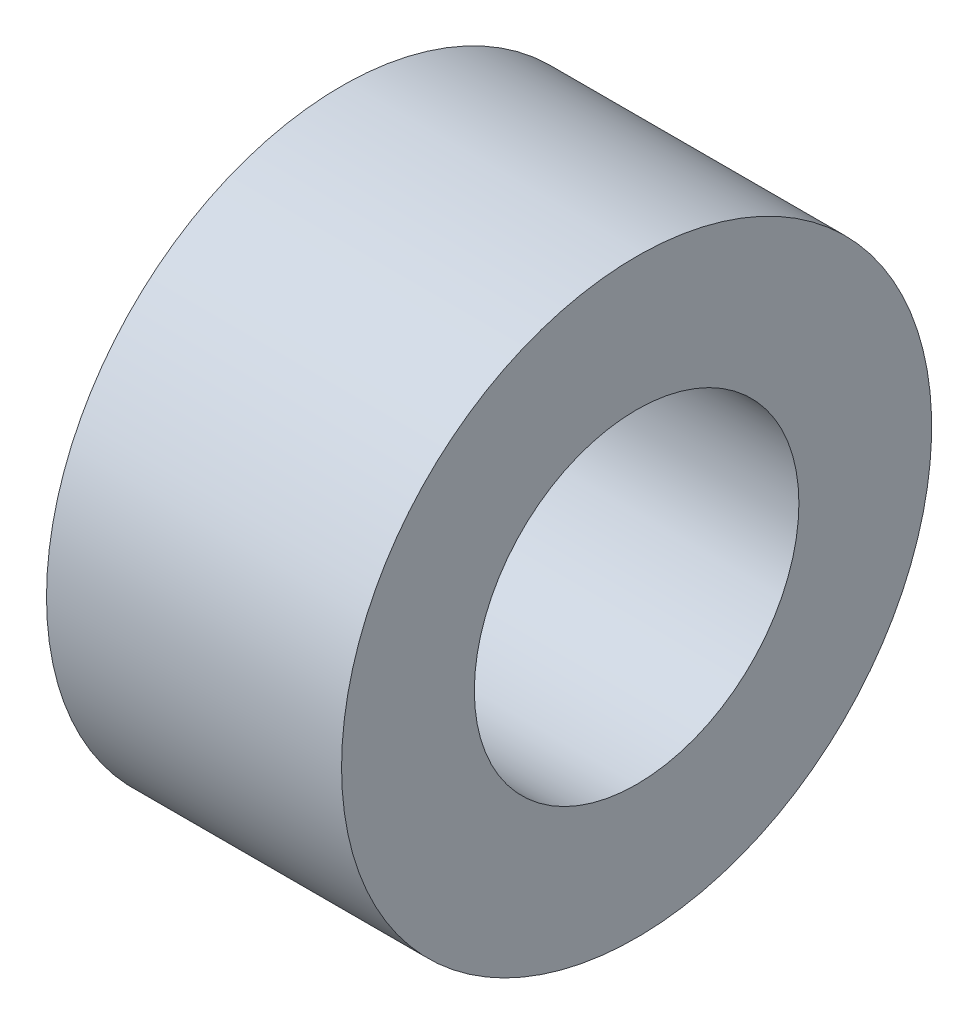
ISO-10303-21;
HEADER;
FILE_DESCRIPTION(('STEP AP214'),'2;1');
FILE_NAME('part.step','',(''),(''),'','','');
FILE_SCHEMA(('AUTOMOTIVE_DESIGN { 1 0 10303 214 1 1 1 1 }'));
ENDSEC;
DATA;
#1=APPLICATION_CONTEXT('core data for automotive mechanical design processes');
#2=APPLICATION_PROTOCOL_DEFINITION('international standard','automotive_design',2000,#1);
#3=PRODUCT_CONTEXT('',#1,'mechanical');
#4=PRODUCT('Part','Part','',(#3));
#5=PRODUCT_RELATED_PRODUCT_CATEGORY('part','',(#4));
#6=PRODUCT_DEFINITION_FORMATION('','',#4);
#7=PRODUCT_DEFINITION_CONTEXT('part definition',#1,'design');
#8=PRODUCT_DEFINITION('design','',#6,#7);
#9=PRODUCT_DEFINITION_SHAPE('','',#8);
#10=(LENGTH_UNIT() NAMED_UNIT(*) SI_UNIT(.MILLI.,.METRE.));
#11=(NAMED_UNIT(*) PLANE_ANGLE_UNIT() SI_UNIT($,.RADIAN.));
#12=(NAMED_UNIT(*) SI_UNIT($,.STERADIAN.) SOLID_ANGLE_UNIT());
#13=UNCERTAINTY_MEASURE_WITH_UNIT(LENGTH_MEASURE(1.E-05),#10,'distance_accuracy_value','');
#14=(GEOMETRIC_REPRESENTATION_CONTEXT(3) GLOBAL_UNCERTAINTY_ASSIGNED_CONTEXT((#13)) GLOBAL_UNIT_ASSIGNED_CONTEXT((#10,
#11,#12)) REPRESENTATION_CONTEXT('',''));
#15=CARTESIAN_POINT('',(0.,0.,0.));
#16=DIRECTION('',(0.,0.,1.));
#17=DIRECTION('',(1.,0.,0.));
#18=AXIS2_PLACEMENT_3D('',#15,#16,#17);
#19=CARTESIAN_POINT('',(0.,2.75,0.));
#20=DIRECTION('',(1.,0.,0.));
#21=DIRECTION('',(0.,0.,-1.));
#22=AXIS2_PLACEMENT_3D('',#19,#20,#21);
#23=PLANE('',#22);
#24=CARTESIAN_POINT('',(0.,0.,0.));
#25=DIRECTION('',(-1.,0.,0.));
#26=DIRECTION('',(0.,0.,1.));
#27=AXIS2_PLACEMENT_3D('',#24,#25,#26);
#28=CIRCLE('',#27,2.75);
#29=CARTESIAN_POINT('',(0.,0.,2.75));
#30=VERTEX_POINT('',#29);
#31=EDGE_CURVE('E48',#30,#30,#28,.T.);
#32=ORIENTED_EDGE('',*,*,#31,.F.);
#33=EDGE_LOOP('',(#32));
#34=FACE_BOUND('',#33,.T.);
#35=CARTESIAN_POINT('',(0.,0.,0.));
#36=DIRECTION('',(-1.,0.,0.));
#37=DIRECTION('',(0.,0.,1.));
#38=AXIS2_PLACEMENT_3D('',#35,#36,#37);
#39=CIRCLE('',#38,5.);
#40=CARTESIAN_POINT('',(0.,0.,5.));
#41=VERTEX_POINT('',#40);
#42=EDGE_CURVE('E10',#41,#41,#39,.T.);
#43=ORIENTED_EDGE('',*,*,#42,.T.);
#44=EDGE_LOOP('',(#43));
#45=FACE_BOUND('',#44,.T.);
#46=ADVANCED_FACE('F34',(#34,#45),#23,.F.);
#47=CARTESIAN_POINT('',(0.,0.,0.));
#48=DIRECTION('',(-1.,0.,0.));
#49=DIRECTION('',(0.,0.,1.));
#50=AXIS2_PLACEMENT_3D('',#47,#48,#49);
#51=CYLINDRICAL_SURFACE('',#50,5.);
#52=ORIENTED_EDGE('',*,*,#42,.F.);
#53=EDGE_LOOP('',(#52));
#54=FACE_BOUND('',#53,.T.);
#55=CARTESIAN_POINT('',(5.,0.,0.));
#56=DIRECTION('',(-1.,0.,0.));
#57=DIRECTION('',(0.,0.,1.));
#58=AXIS2_PLACEMENT_3D('',#55,#56,#57);
#59=CIRCLE('',#58,5.);
#60=CARTESIAN_POINT('',(5.,0.,5.));
#61=VERTEX_POINT('',#60);
#62=EDGE_CURVE('E40',#61,#61,#59,.T.);
#63=ORIENTED_EDGE('',*,*,#62,.T.);
#64=EDGE_LOOP('',(#63));
#65=FACE_BOUND('',#64,.T.);
#66=ADVANCED_FACE('F57',(#54,#65),#51,.T.);
#67=CARTESIAN_POINT('',(5.,2.75,0.));
#68=DIRECTION('',(-1.,0.,0.));
#69=DIRECTION('',(0.,0.,1.));
#70=AXIS2_PLACEMENT_3D('',#67,#68,#69);
#71=PLANE('',#70);
#72=ORIENTED_EDGE('',*,*,#62,.F.);
#73=EDGE_LOOP('',(#72));
#74=FACE_BOUND('',#73,.T.);
#75=CARTESIAN_POINT('',(5.,0.,0.));
#76=DIRECTION('',(-1.,0.,0.));
#77=DIRECTION('',(0.,0.,1.));
#78=AXIS2_PLACEMENT_3D('',#75,#76,#77);
#79=CIRCLE('',#78,2.75);
#80=CARTESIAN_POINT('',(5.,0.,2.75));
#81=VERTEX_POINT('',#80);
#82=EDGE_CURVE('E44',#81,#81,#79,.T.);
#83=ORIENTED_EDGE('',*,*,#82,.T.);
#84=EDGE_LOOP('',(#83));
#85=FACE_BOUND('',#84,.T.);
#86=ADVANCED_FACE('F61',(#74,#85),#71,.F.);
#87=CARTESIAN_POINT('',(0.,0.,0.));
#88=DIRECTION('',(-1.,0.,0.));
#89=DIRECTION('',(0.,0.,1.));
#90=AXIS2_PLACEMENT_3D('',#87,#88,#89);
#91=CYLINDRICAL_SURFACE('',#90,2.75);
#92=ORIENTED_EDGE('',*,*,#82,.F.);
#93=EDGE_LOOP('',(#92));
#94=FACE_BOUND('',#93,.T.);
#95=ORIENTED_EDGE('',*,*,#31,.T.);
#96=EDGE_LOOP('',(#95));
#97=FACE_BOUND('',#96,.T.);
#98=ADVANCED_FACE('F54',(#94,#97),#91,.F.);
#99=CLOSED_SHELL('',(#46,#66,#86,#98));
#100=MANIFOLD_SOLID_BREP('B2',#99);
#101=ADVANCED_BREP_SHAPE_REPRESENTATION('',(#18,#100),#14);
#102=SHAPE_DEFINITION_REPRESENTATION(#9,#101);
ENDSEC;
END-ISO-10303-21;
